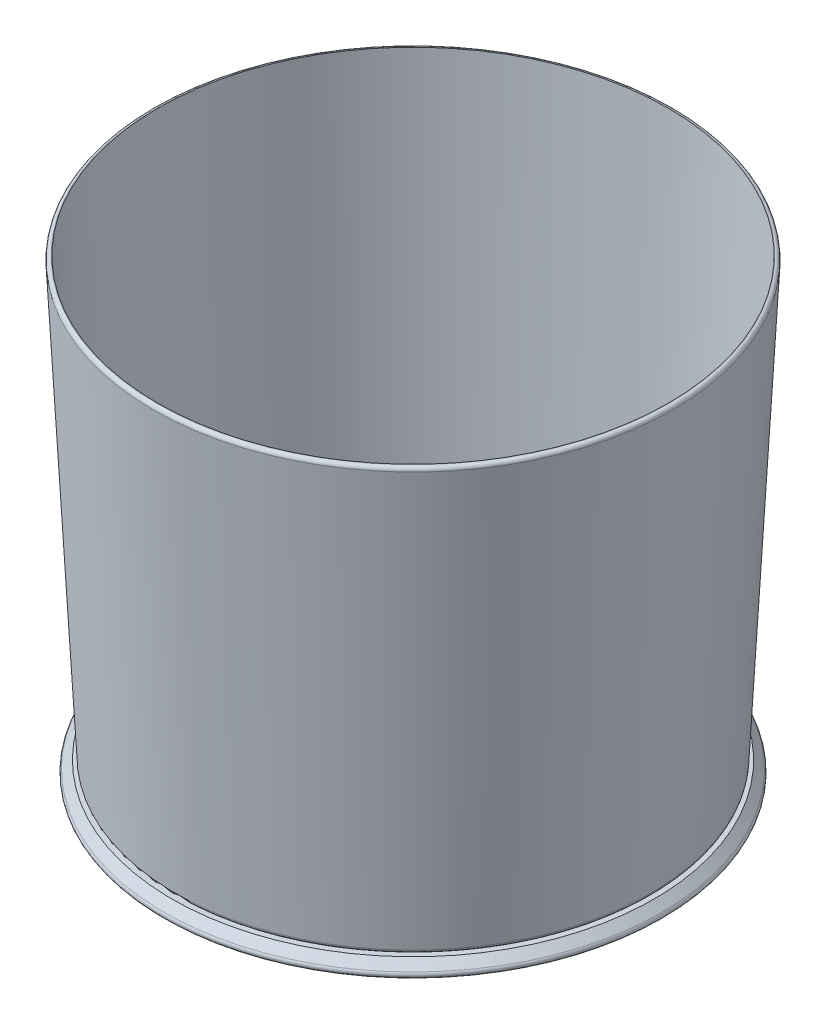
ISO-10303-21;
HEADER;
FILE_DESCRIPTION(('STEP AP214'),'2;1');
FILE_NAME('part.step','',(''),(''),'','','');
FILE_SCHEMA(('AUTOMOTIVE_DESIGN { 1 0 10303 214 1 1 1 1 }'));
ENDSEC;
DATA;
#1=APPLICATION_CONTEXT('core data for automotive mechanical design processes');
#2=APPLICATION_PROTOCOL_DEFINITION('international standard','automotive_design',2000,#1);
#3=PRODUCT_CONTEXT('',#1,'mechanical');
#4=PRODUCT('Part','Part','',(#3));
#5=PRODUCT_RELATED_PRODUCT_CATEGORY('part','',(#4));
#6=PRODUCT_DEFINITION_FORMATION('','',#4);
#7=PRODUCT_DEFINITION_CONTEXT('part definition',#1,'design');
#8=PRODUCT_DEFINITION('design','',#6,#7);
#9=PRODUCT_DEFINITION_SHAPE('','',#8);
#10=(LENGTH_UNIT() NAMED_UNIT(*) SI_UNIT(.MILLI.,.METRE.));
#11=(NAMED_UNIT(*) PLANE_ANGLE_UNIT() SI_UNIT($,.RADIAN.));
#12=(NAMED_UNIT(*) SI_UNIT($,.STERADIAN.) SOLID_ANGLE_UNIT());
#13=UNCERTAINTY_MEASURE_WITH_UNIT(LENGTH_MEASURE(1.E-05),#10,'distance_accuracy_value','');
#14=(GEOMETRIC_REPRESENTATION_CONTEXT(3) GLOBAL_UNCERTAINTY_ASSIGNED_CONTEXT((#13)) GLOBAL_UNIT_ASSIGNED_CONTEXT((#10,
#11,#12)) REPRESENTATION_CONTEXT('',''));
#15=CARTESIAN_POINT('',(0.,0.,0.));
#16=DIRECTION('',(0.,0.,1.));
#17=DIRECTION('',(1.,0.,0.));
#18=AXIS2_PLACEMENT_3D('',#15,#16,#17);
#19=CARTESIAN_POINT('',(-150.008312881908,-479.000284852509,0.));
#20=DIRECTION('',(0.,-1.,0.));
#21=DIRECTION('',(1.,0.,0.));
#22=AXIS2_PLACEMENT_3D('',#19,#20,#21);
#23=CONICAL_SURFACE('',#22,341.487526132732,0.785398163397448);
#24=CARTESIAN_POINT('',(-150.008312881908,-468.383325668626,0.));
#25=DIRECTION('',(0.,1.,0.));
#26=DIRECTION('',(-1.,0.,0.));
#27=AXIS2_PLACEMENT_3D('',#24,#25,#26);
#28=CIRCLE('',#27,330.870566948849);
#29=CARTESIAN_POINT('',(-480.878879830757,-468.383325668626,0.));
#30=VERTEX_POINT('',#29);
#31=EDGE_CURVE('E88',#30,#30,#28,.T.);
#32=ORIENTED_EDGE('',*,*,#31,.F.);
#33=EDGE_LOOP('',(#32));
#34=FACE_BOUND('',#33,.T.);
#35=CARTESIAN_POINT('',(-150.008312881908,-479.000284852509,0.));
#36=DIRECTION('',(0.,1.,0.));
#37=DIRECTION('',(-1.,0.,0.));
#38=AXIS2_PLACEMENT_3D('',#35,#36,#37);
#39=CIRCLE('',#38,341.487526132732);
#40=CARTESIAN_POINT('',(-491.495839014641,-479.000284852509,0.));
#41=VERTEX_POINT('',#40);
#42=EDGE_CURVE('E10',#41,#41,#39,.T.);
#43=ORIENTED_EDGE('',*,*,#42,.T.);
#44=EDGE_LOOP('',(#43));
#45=FACE_BOUND('',#44,.T.);
#46=ADVANCED_FACE('F37',(#34,#45),#23,.T.);
#47=CARTESIAN_POINT('',(-150.008312881908,-482.535818758442,0.));
#48=DIRECTION('',(0.,1.,0.));
#49=DIRECTION('',(-1.,0.,0.));
#50=AXIS2_PLACEMENT_3D('',#47,#48,#49);
#51=TOROIDAL_SURFACE('',#50,337.9519922268,4.99999999999997);
#52=ORIENTED_EDGE('',*,*,#42,.F.);
#53=EDGE_LOOP('',(#52));
#54=FACE_BOUND('',#53,.T.);
#55=CARTESIAN_POINT('',(-150.008312881908,-487.535818758442,0.));
#56=DIRECTION('',(0.,1.,0.));
#57=DIRECTION('',(-1.,0.,0.));
#58=AXIS2_PLACEMENT_3D('',#55,#56,#57);
#59=CIRCLE('',#58,337.9519922268);
#60=CARTESIAN_POINT('',(-487.960305108708,-487.535818758442,0.));
#61=VERTEX_POINT('',#60);
#62=EDGE_CURVE('E44',#61,#61,#59,.T.);
#63=ORIENTED_EDGE('',*,*,#62,.T.);
#64=EDGE_LOOP('',(#63));
#65=FACE_BOUND('',#64,.T.);
#66=ADVANCED_FACE('F96',(#54,#65),#51,.T.);
#67=CARTESIAN_POINT('',(187.943679344891,-487.535818758442,0.));
#68=DIRECTION('',(0.,1.,0.));
#69=DIRECTION('',(-1.,0.,0.));
#70=AXIS2_PLACEMENT_3D('',#67,#68,#69);
#71=PLANE('',#70);
#72=ORIENTED_EDGE('',*,*,#62,.F.);
#73=EDGE_LOOP('',(#72));
#74=FACE_BOUND('',#73,.T.);
#75=CARTESIAN_POINT('',(-150.008312881908,-487.535818758442,0.));
#76=DIRECTION('',(0.,1.,0.));
#77=DIRECTION('',(-1.,0.,0.));
#78=AXIS2_PLACEMENT_3D('',#75,#76,#77);
#79=CIRCLE('',#78,0.868798038333523);
#80=CARTESIAN_POINT('',(-150.877110920242,-487.535818758442,0.));
#81=VERTEX_POINT('',#80);
#82=EDGE_CURVE('E49',#81,#81,#79,.T.);
#83=ORIENTED_EDGE('',*,*,#82,.T.);
#84=EDGE_LOOP('',(#83));
#85=FACE_BOUND('',#84,.T.);
#86=ADVANCED_FACE('F100',(#74,#85),#71,.F.);
#87=CARTESIAN_POINT('',(-150.008312881909,-212.837137396086,0.));
#88=DIRECTION('',(0.,1.,0.));
#89=DIRECTION('',(-1.,0.,0.));
#90=AXIS2_PLACEMENT_3D('',#87,#88,#89);
#91=CYLINDRICAL_SURFACE('',#90,0.868798038333535);
#92=ORIENTED_EDGE('',*,*,#82,.F.);
#93=EDGE_LOOP('',(#92));
#94=FACE_BOUND('',#93,.T.);
#95=CARTESIAN_POINT('',(-150.008312881908,-457.535818758442,0.));
#96=DIRECTION('',(0.,1.,0.));
#97=DIRECTION('',(-1.,0.,0.));
#98=AXIS2_PLACEMENT_3D('',#95,#96,#97);
#99=CIRCLE('',#98,0.86879803833353);
#100=CARTESIAN_POINT('',(-150.877110920242,-457.535818758442,0.));
#101=VERTEX_POINT('',#100);
#102=EDGE_CURVE('E54',#101,#101,#99,.T.);
#103=ORIENTED_EDGE('',*,*,#102,.T.);
#104=EDGE_LOOP('',(#103));
#105=FACE_BOUND('',#104,.T.);
#106=ADVANCED_FACE('F105',(#94,#105),#91,.F.);
#107=CARTESIAN_POINT('',(-149.139514843575,-457.535818758442,0.));
#108=DIRECTION('',(0.,-1.,0.));
#109=DIRECTION('',(1.,0.,0.));
#110=AXIS2_PLACEMENT_3D('',#107,#108,#109);
#111=PLANE('',#110);
#112=ORIENTED_EDGE('',*,*,#102,.F.);
#113=EDGE_LOOP('',(#112));
#114=FACE_BOUND('',#113,.T.);
#115=CARTESIAN_POINT('',(-150.008312881908,-457.535818758442,0.));
#116=DIRECTION('',(0.,1.,0.));
#117=DIRECTION('',(-1.,0.,0.));
#118=AXIS2_PLACEMENT_3D('',#115,#116,#117);
#119=CIRCLE('',#118,315.998686847698);
#120=CARTESIAN_POINT('',(-466.006999729607,-457.535818758442,0.));
#121=VERTEX_POINT('',#120);
#122=EDGE_CURVE('E60',#121,#121,#119,.T.);
#123=ORIENTED_EDGE('',*,*,#122,.T.);
#124=EDGE_LOOP('',(#123));
#125=FACE_BOUND('',#124,.T.);
#126=ADVANCED_FACE('F111',(#114,#125),#111,.F.);
#127=CARTESIAN_POINT('',(-150.008312881908,-452.535818758442,0.));
#128=DIRECTION('',(0.,1.,0.));
#129=DIRECTION('',(-1.,0.,0.));
#130=AXIS2_PLACEMENT_3D('',#127,#128,#129);
#131=TOROIDAL_SURFACE('',#130,315.998686847698,5.00000000000002);
#132=ORIENTED_EDGE('',*,*,#122,.F.);
#133=EDGE_LOOP('',(#132));
#134=FACE_BOUND('',#133,.T.);
#135=CARTESIAN_POINT('',(-150.008312881908,-452.791099984037,0.));
#136=DIRECTION('',(0.,1.,0.));
#137=DIRECTION('',(-1.,0.,0.));
#138=AXIS2_PLACEMENT_3D('',#135,#136,#137);
#139=CIRCLE('',#138,320.992165744806);
#140=CARTESIAN_POINT('',(-471.000478626714,-452.791099984037,0.));
#141=VERTEX_POINT('',#140);
#142=EDGE_CURVE('E64',#141,#141,#139,.T.);
#143=ORIENTED_EDGE('',*,*,#142,.T.);
#144=EDGE_LOOP('',(#143));
#145=FACE_BOUND('',#144,.T.);
#146=ADVANCED_FACE('F115',(#134,#145),#131,.F.);
#147=CARTESIAN_POINT('',(-150.008312881909,131.616674331374,0.));
#148=DIRECTION('',(0.,1.,0.));
#149=DIRECTION('',(-1.,0.,0.));
#150=AXIS2_PLACEMENT_3D('',#147,#148,#149);
#151=CONICAL_SURFACE('',#150,350.868798038334,0.0510784529067837);
#152=ORIENTED_EDGE('',*,*,#142,.F.);
#153=EDGE_LOOP('',(#152));
#154=FACE_BOUND('',#153,.T.);
#155=CARTESIAN_POINT('',(-150.008312881909,131.616674331374,0.));
#156=DIRECTION('',(0.,1.,0.));
#157=DIRECTION('',(-1.,0.,0.));
#158=AXIS2_PLACEMENT_3D('',#155,#156,#157);
#159=CIRCLE('',#158,350.868798038334);
#160=CARTESIAN_POINT('',(-500.877110920242,131.616674331374,0.));
#161=VERTEX_POINT('',#160);
#162=EDGE_CURVE('E68',#161,#161,#159,.T.);
#163=ORIENTED_EDGE('',*,*,#162,.T.);
#164=EDGE_LOOP('',(#163));
#165=FACE_BOUND('',#164,.T.);
#166=ADVANCED_FACE('F119',(#154,#165),#151,.F.);
#167=CARTESIAN_POINT('',(201.522947239519,131.616674331374,0.));
#168=DIRECTION('',(0.,-1.,0.));
#169=DIRECTION('',(1.,0.,0.));
#170=AXIS2_PLACEMENT_3D('',#167,#168,#169);
#171=PLANE('',#170);
#172=ORIENTED_EDGE('',*,*,#162,.F.);
#173=EDGE_LOOP('',(#172));
#174=FACE_BOUND('',#173,.T.);
#175=CARTESIAN_POINT('',(-150.008312881909,131.616674331374,0.));
#176=DIRECTION('',(0.,1.,0.));
#177=DIRECTION('',(-1.,0.,0.));
#178=AXIS2_PLACEMENT_3D('',#175,#176,#177);
#179=CIRCLE('',#178,351.531260121428);
#180=CARTESIAN_POINT('',(-501.539573003336,131.616674331374,0.));
#181=VERTEX_POINT('',#180);
#182=EDGE_CURVE('E72',#181,#181,#179,.T.);
#183=ORIENTED_EDGE('',*,*,#182,.T.);
#184=EDGE_LOOP('',(#183));
#185=FACE_BOUND('',#184,.T.);
#186=ADVANCED_FACE('F123',(#174,#185),#171,.F.);
#187=CARTESIAN_POINT('',(-150.008312881909,126.616674331374,0.));
#188=DIRECTION('',(0.,1.,0.));
#189=DIRECTION('',(-1.,0.,0.));
#190=AXIS2_PLACEMENT_3D('',#187,#188,#189);
#191=TOROIDAL_SURFACE('',#190,351.531260121428,5.00000000000001);
#192=ORIENTED_EDGE('',*,*,#182,.F.);
#193=EDGE_LOOP('',(#192));
#194=FACE_BOUND('',#193,.T.);
#195=CARTESIAN_POINT('',(-150.008312881909,126.361393105779,0.));
#196=DIRECTION('',(0.,1.,0.));
#197=DIRECTION('',(-1.,0.,0.));
#198=AXIS2_PLACEMENT_3D('',#195,#196,#197);
#199=CIRCLE('',#198,356.524739018535);
#200=CARTESIAN_POINT('',(-506.533051900444,126.361393105779,0.));
#201=VERTEX_POINT('',#200);
#202=EDGE_CURVE('E76',#201,#201,#199,.T.);
#203=ORIENTED_EDGE('',*,*,#202,.T.);
#204=EDGE_LOOP('',(#203));
#205=FACE_BOUND('',#204,.T.);
#206=ADVANCED_FACE('F127',(#194,#205),#191,.T.);
#207=CARTESIAN_POINT('',(-150.008312881908,-463.638606894221,0.));
#208=DIRECTION('',(0.,1.,0.));
#209=DIRECTION('',(-1.,0.,0.));
#210=AXIS2_PLACEMENT_3D('',#207,#208,#209);
#211=CONICAL_SURFACE('',#210,326.362215814886,0.0510784529067839);
#212=ORIENTED_EDGE('',*,*,#202,.F.);
#213=EDGE_LOOP('',(#212));
#214=FACE_BOUND('',#213,.T.);
#215=CARTESIAN_POINT('',(-150.008312881908,-463.638606894221,0.));
#216=DIRECTION('',(0.,1.,0.));
#217=DIRECTION('',(-1.,0.,0.));
#218=AXIS2_PLACEMENT_3D('',#215,#216,#217);
#219=CIRCLE('',#218,326.362215814886);
#220=CARTESIAN_POINT('',(-476.370528696795,-463.638606894221,0.));
#221=VERTEX_POINT('',#220);
#222=EDGE_CURVE('E80',#221,#221,#219,.T.);
#223=ORIENTED_EDGE('',*,*,#222,.T.);
#224=EDGE_LOOP('',(#223));
#225=FACE_BOUND('',#224,.T.);
#226=ADVANCED_FACE('F131',(#214,#225),#211,.T.);
#227=CARTESIAN_POINT('',(-150.008312881908,-463.383325668626,0.));
#228=DIRECTION('',(0.,1.,0.));
#229=DIRECTION('',(-1.,0.,0.));
#230=AXIS2_PLACEMENT_3D('',#227,#228,#229);
#231=TOROIDAL_SURFACE('',#230,321.368736917779,5.00000000000001);
#232=ORIENTED_EDGE('',*,*,#222,.F.);
#233=EDGE_LOOP('',(#232));
#234=FACE_BOUND('',#233,.T.);
#235=CARTESIAN_POINT('',(-150.008312881908,-468.383325668626,0.));
#236=DIRECTION('',(0.,1.,0.));
#237=DIRECTION('',(-1.,0.,0.));
#238=AXIS2_PLACEMENT_3D('',#235,#236,#237);
#239=CIRCLE('',#238,321.368736917779);
#240=CARTESIAN_POINT('',(-471.377049799687,-468.383325668626,0.));
#241=VERTEX_POINT('',#240);
#242=EDGE_CURVE('E84',#241,#241,#239,.T.);
#243=ORIENTED_EDGE('',*,*,#242,.T.);
#244=EDGE_LOOP('',(#243));
#245=FACE_BOUND('',#244,.T.);
#246=ADVANCED_FACE('F135',(#234,#245),#231,.T.);
#247=CARTESIAN_POINT('',(180.86225406694,-468.383325668626,0.));
#248=DIRECTION('',(0.,-1.,0.));
#249=DIRECTION('',(1.,0.,0.));
#250=AXIS2_PLACEMENT_3D('',#247,#248,#249);
#251=PLANE('',#250);
#252=ORIENTED_EDGE('',*,*,#242,.F.);
#253=EDGE_LOOP('',(#252));
#254=FACE_BOUND('',#253,.T.);
#255=ORIENTED_EDGE('',*,*,#31,.T.);
#256=EDGE_LOOP('',(#255));
#257=FACE_BOUND('',#256,.T.);
#258=ADVANCED_FACE('F93',(#254,#257),#251,.F.);
#259=CLOSED_SHELL('',(#46,#66,#86,#106,#126,#146,#166,#186,#206,#226,#246,#258));
#260=MANIFOLD_SOLID_BREP('B2',#259);
#261=ADVANCED_BREP_SHAPE_REPRESENTATION('',(#18,#260),#14);
#262=SHAPE_DEFINITION_REPRESENTATION(#9,#261);
ENDSEC;
END-ISO-10303-21;
